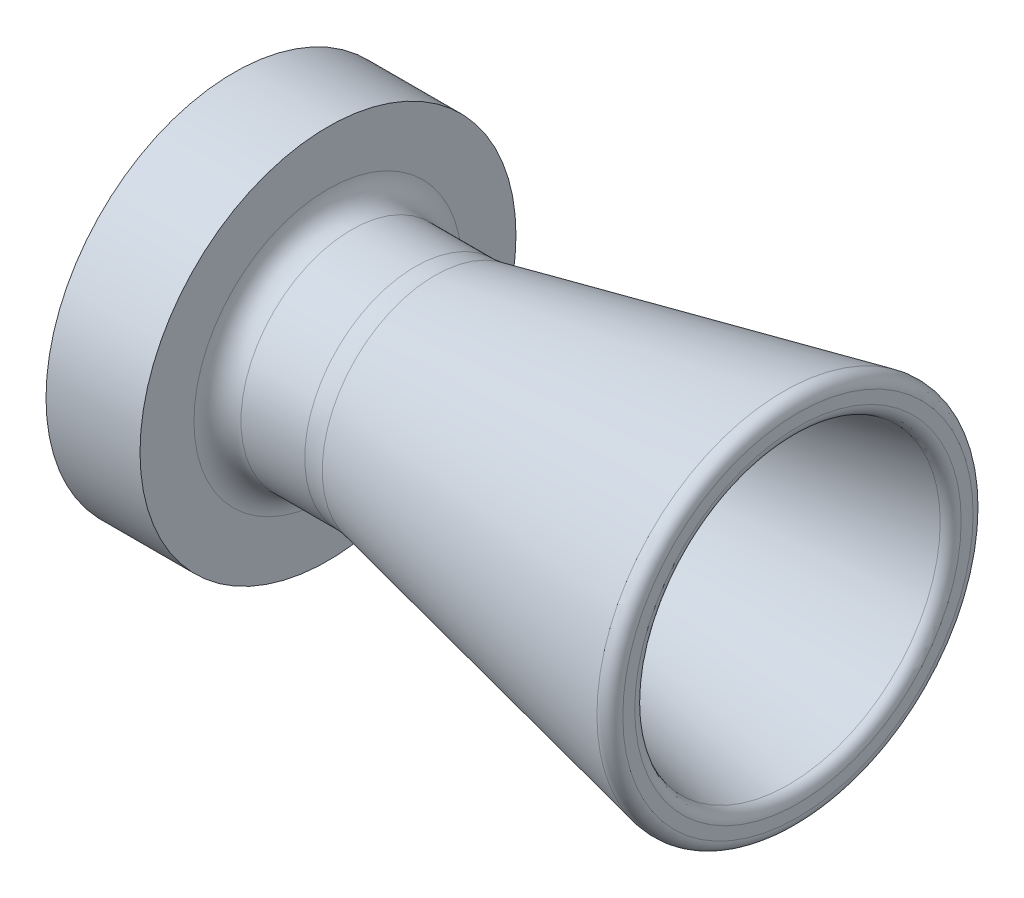
ISO-10303-21;
HEADER;
FILE_DESCRIPTION(('STEP AP214'),'2;1');
FILE_NAME('part.step','',(''),(''),'','','');
FILE_SCHEMA(('AUTOMOTIVE_DESIGN { 1 0 10303 214 1 1 1 1 }'));
ENDSEC;
DATA;
#1=APPLICATION_CONTEXT('core data for automotive mechanical design processes');
#2=APPLICATION_PROTOCOL_DEFINITION('international standard','automotive_design',2000,#1);
#3=PRODUCT_CONTEXT('',#1,'mechanical');
#4=PRODUCT('Part','Part','',(#3));
#5=PRODUCT_RELATED_PRODUCT_CATEGORY('part','',(#4));
#6=PRODUCT_DEFINITION_FORMATION('','',#4);
#7=PRODUCT_DEFINITION_CONTEXT('part definition',#1,'design');
#8=PRODUCT_DEFINITION('design','',#6,#7);
#9=PRODUCT_DEFINITION_SHAPE('','',#8);
#10=(LENGTH_UNIT() NAMED_UNIT(*) SI_UNIT(.MILLI.,.METRE.));
#11=(NAMED_UNIT(*) PLANE_ANGLE_UNIT() SI_UNIT($,.RADIAN.));
#12=(NAMED_UNIT(*) SI_UNIT($,.STERADIAN.) SOLID_ANGLE_UNIT());
#13=UNCERTAINTY_MEASURE_WITH_UNIT(LENGTH_MEASURE(1.E-05),#10,'distance_accuracy_value','');
#14=(GEOMETRIC_REPRESENTATION_CONTEXT(3) GLOBAL_UNCERTAINTY_ASSIGNED_CONTEXT((#13)) GLOBAL_UNIT_ASSIGNED_CONTEXT((#10,
#11,#12)) REPRESENTATION_CONTEXT('',''));
#15=CARTESIAN_POINT('',(0.,0.,0.));
#16=DIRECTION('',(0.,0.,1.));
#17=DIRECTION('',(1.,0.,0.));
#18=AXIS2_PLACEMENT_3D('',#15,#16,#17);
#19=CARTESIAN_POINT('',(-76.2,0.,9.525));
#20=DIRECTION('',(1.,0.,0.));
#21=DIRECTION('',(0.,0.,-1.));
#22=AXIS2_PLACEMENT_3D('',#19,#20,#21);
#23=PLANE('',#22);
#24=CARTESIAN_POINT('',(-76.2,0.,0.));
#25=DIRECTION('',(1.,0.,0.));
#26=DIRECTION('',(0.,0.,-1.));
#27=AXIS2_PLACEMENT_3D('',#24,#25,#26);
#28=CIRCLE('',#27,25.4);
#29=CARTESIAN_POINT('',(-76.2,0.,-25.4));
#30=VERTEX_POINT('',#29);
#31=EDGE_CURVE('E80',#30,#30,#28,.T.);
#32=ORIENTED_EDGE('',*,*,#31,.F.);
#33=EDGE_LOOP('',(#32));
#34=FACE_BOUND('',#33,.T.);
#35=CARTESIAN_POINT('',(-76.2,0.,0.));
#36=DIRECTION('',(1.,0.,0.));
#37=DIRECTION('',(0.,0.,-1.));
#38=AXIS2_PLACEMENT_3D('',#35,#36,#37);
#39=CIRCLE('',#38,9.525);
#40=CARTESIAN_POINT('',(-76.2,0.,-9.525));
#41=VERTEX_POINT('',#40);
#42=EDGE_CURVE('E10',#41,#41,#39,.T.);
#43=ORIENTED_EDGE('',*,*,#42,.T.);
#44=EDGE_LOOP('',(#43));
#45=FACE_BOUND('',#44,.T.);
#46=ADVANCED_FACE('F31',(#34,#45),#23,.F.);
#47=CARTESIAN_POINT('',(88.99,0.,0.));
#48=DIRECTION('',(1.,0.,0.));
#49=DIRECTION('',(0.,0.,-1.));
#50=AXIS2_PLACEMENT_3D('',#47,#48,#49);
#51=CYLINDRICAL_SURFACE('',#50,9.525);
#52=CARTESIAN_POINT('',(-63.5,0.,0.));
#53=DIRECTION('',(1.,0.,0.));
#54=DIRECTION('',(0.,0.,-1.));
#55=AXIS2_PLACEMENT_3D('',#52,#53,#54);
#56=CIRCLE('',#55,9.525);
#57=CARTESIAN_POINT('',(-63.5,0.,-9.525));
#58=VERTEX_POINT('',#57);
#59=EDGE_CURVE('E37',#58,#58,#56,.T.);
#60=ORIENTED_EDGE('',*,*,#59,.T.);
#61=EDGE_LOOP('',(#60));
#62=FACE_BOUND('',#61,.T.);
#63=ORIENTED_EDGE('',*,*,#42,.F.);
#64=EDGE_LOOP('',(#63));
#65=FACE_BOUND('',#64,.T.);
#66=ADVANCED_FACE('F87',(#62,#65),#51,.F.);
#67=CARTESIAN_POINT('',(-63.5,0.,9.525));
#68=DIRECTION('',(1.,0.,0.));
#69=DIRECTION('',(0.,0.,-1.));
#70=AXIS2_PLACEMENT_3D('',#67,#68,#69);
#71=PLANE('',#70);
#72=CARTESIAN_POINT('',(-63.5,0.,0.));
#73=DIRECTION('',(1.,0.,0.));
#74=DIRECTION('',(0.,0.,-1.));
#75=AXIS2_PLACEMENT_3D('',#72,#73,#74);
#76=CIRCLE('',#75,10.16);
#77=CARTESIAN_POINT('',(-63.5,0.,-10.16));
#78=VERTEX_POINT('',#77);
#79=EDGE_CURVE('E41',#78,#78,#76,.T.);
#80=ORIENTED_EDGE('',*,*,#79,.T.);
#81=EDGE_LOOP('',(#80));
#82=FACE_BOUND('',#81,.T.);
#83=ORIENTED_EDGE('',*,*,#59,.F.);
#84=EDGE_LOOP('',(#83));
#85=FACE_BOUND('',#84,.T.);
#86=ADVANCED_FACE('F91',(#82,#85),#71,.T.);
#87=CARTESIAN_POINT('',(88.99,0.,0.));
#88=DIRECTION('',(1.,0.,0.));
#89=DIRECTION('',(0.,0.,-1.));
#90=AXIS2_PLACEMENT_3D('',#87,#88,#89);
#91=CYLINDRICAL_SURFACE('',#90,10.16);
#92=CARTESIAN_POINT('',(-51.2011300436334,0.,0.));
#93=DIRECTION('',(1.,0.,0.));
#94=DIRECTION('',(0.,0.,-1.));
#95=AXIS2_PLACEMENT_3D('',#92,#93,#94);
#96=CIRCLE('',#95,10.16);
#97=CARTESIAN_POINT('',(-51.2011300436334,0.,-10.16));
#98=VERTEX_POINT('',#97);
#99=EDGE_CURVE('E45',#98,#98,#96,.T.);
#100=ORIENTED_EDGE('',*,*,#99,.T.);
#101=EDGE_LOOP('',(#100));
#102=FACE_BOUND('',#101,.T.);
#103=ORIENTED_EDGE('',*,*,#79,.F.);
#104=EDGE_LOOP('',(#103));
#105=FACE_BOUND('',#104,.T.);
#106=ADVANCED_FACE('F95',(#102,#105),#91,.F.);
#107=CARTESIAN_POINT('',(-51.2011300436334,0.,0.));
#108=DIRECTION('',(1.,0.,0.));
#109=DIRECTION('',(0.,0.,-1.));
#110=AXIS2_PLACEMENT_3D('',#107,#108,#109);
#111=TOROIDAL_SURFACE('',#110,22.86,12.7);
#112=CARTESIAN_POINT('',(-48.560651570248,0.,0.));
#113=DIRECTION('',(1.,0.,0.));
#114=DIRECTION('',(0.,0.,-1.));
#115=AXIS2_PLACEMENT_3D('',#112,#113,#114);
#116=CIRCLE('',#115,10.4375254706807);
#117=CARTESIAN_POINT('',(-48.560651570248,0.,-10.4375254706807));
#118=VERTEX_POINT('',#117);
#119=EDGE_CURVE('E50',#118,#118,#116,.T.);
#120=ORIENTED_EDGE('',*,*,#119,.T.);
#121=EDGE_LOOP('',(#120));
#122=FACE_BOUND('',#121,.T.);
#123=ORIENTED_EDGE('',*,*,#99,.F.);
#124=EDGE_LOOP('',(#123));
#125=FACE_BOUND('',#124,.T.);
#126=ADVANCED_FACE('F102',(#122,#125),#111,.T.);
#127=CARTESIAN_POINT('',(-1.26749971235345,0.,0.));
#128=DIRECTION('',(1.,0.,0.));
#129=DIRECTION('',(0.,0.,-1.));
#130=AXIS2_PLACEMENT_3D('',#127,#128,#129);
#131=CONICAL_SURFACE('',#130,20.4899952201326,0.209439510239313);
#132=ORIENTED_EDGE('',*,*,#119,.F.);
#133=EDGE_LOOP('',(#132));
#134=FACE_BOUND('',#133,.T.);
#135=CARTESIAN_POINT('',(-1.26749971235345,0.,0.));
#136=DIRECTION('',(1.,0.,0.));
#137=DIRECTION('',(0.,0.,-1.));
#138=AXIS2_PLACEMENT_3D('',#135,#136,#137);
#139=CIRCLE('',#138,20.4899952201326);
#140=CARTESIAN_POINT('',(-1.26749971235345,0.,-20.4899952201326));
#141=VERTEX_POINT('',#140);
#142=EDGE_CURVE('E53',#141,#141,#139,.T.);
#143=ORIENTED_EDGE('',*,*,#142,.T.);
#144=EDGE_LOOP('',(#143));
#145=FACE_BOUND('',#144,.T.);
#146=ADVANCED_FACE('F106',(#134,#145),#131,.F.);
#147=CARTESIAN_POINT('',(-1.60020000000001,0.,0.));
#148=DIRECTION('',(1.,0.,0.));
#149=DIRECTION('',(0.,0.,-1.));
#150=AXIS2_PLACEMENT_3D('',#147,#148,#149);
#151=TOROIDAL_SURFACE('',#150,22.0552270108268,1.6002);
#152=ORIENTED_EDGE('',*,*,#142,.F.);
#153=EDGE_LOOP('',(#152));
#154=FACE_BOUND('',#153,.T.);
#155=CARTESIAN_POINT('',(0.,0.,0.));
#156=DIRECTION('',(1.,0.,0.));
#157=DIRECTION('',(0.,0.,-1.));
#158=AXIS2_PLACEMENT_3D('',#155,#156,#157);
#159=CIRCLE('',#158,22.0552270108268);
#160=CARTESIAN_POINT('',(0.,0.,-22.0552270108268));
#161=VERTEX_POINT('',#160);
#162=EDGE_CURVE('E56',#161,#161,#159,.T.);
#163=ORIENTED_EDGE('',*,*,#162,.T.);
#164=EDGE_LOOP('',(#163));
#165=FACE_BOUND('',#164,.T.);
#166=ADVANCED_FACE('F110',(#154,#165),#151,.T.);
#167=CARTESIAN_POINT('',(0.,0.,22.0552270108268));
#168=DIRECTION('',(1.,0.,0.));
#169=DIRECTION('',(0.,0.,-1.));
#170=AXIS2_PLACEMENT_3D('',#167,#168,#169);
#171=PLANE('',#170);
#172=CARTESIAN_POINT('',(0.,0.,0.));
#173=DIRECTION('',(1.,0.,0.));
#174=DIRECTION('',(0.,0.,-1.));
#175=AXIS2_PLACEMENT_3D('',#172,#173,#174);
#176=CIRCLE('',#175,23.6652089796203);
#177=CARTESIAN_POINT('',(0.,0.,-23.6652089796203));
#178=VERTEX_POINT('',#177);
#179=EDGE_CURVE('E59',#178,#178,#176,.T.);
#180=ORIENTED_EDGE('',*,*,#179,.T.);
#181=EDGE_LOOP('',(#180));
#182=FACE_BOUND('',#181,.T.);
#183=ORIENTED_EDGE('',*,*,#162,.F.);
#184=EDGE_LOOP('',(#183));
#185=FACE_BOUND('',#184,.T.);
#186=ADVANCED_FACE('F114',(#182,#185),#171,.T.);
#187=CARTESIAN_POINT('',(-1.60020000000001,0.,0.));
#188=DIRECTION('',(1.,0.,0.));
#189=DIRECTION('',(0.,0.,-1.));
#190=AXIS2_PLACEMENT_3D('',#187,#188,#189);
#191=TOROIDAL_SURFACE('',#190,23.6652089796203,1.6002);
#192=ORIENTED_EDGE('',*,*,#179,.F.);
#193=EDGE_LOOP('',(#192));
#194=FACE_BOUND('',#193,.T.);
#195=CARTESIAN_POINT('',(-1.93290028764657,0.,0.));
#196=DIRECTION('',(1.,0.,0.));
#197=DIRECTION('',(0.,0.,-1.));
#198=AXIS2_PLACEMENT_3D('',#195,#196,#197);
#199=CIRCLE('',#198,25.2304407703145);
#200=CARTESIAN_POINT('',(-1.93290028764657,0.,-25.2304407703145));
#201=VERTEX_POINT('',#200);
#202=EDGE_CURVE('E62',#201,#201,#199,.T.);
#203=ORIENTED_EDGE('',*,*,#202,.T.);
#204=EDGE_LOOP('',(#203));
#205=FACE_BOUND('',#204,.T.);
#206=ADVANCED_FACE('F118',(#194,#205),#191,.T.);
#207=CARTESIAN_POINT('',(-1.93290028764657,0.,0.));
#208=DIRECTION('',(1.,0.,0.));
#209=DIRECTION('',(0.,0.,-1.));
#210=AXIS2_PLACEMENT_3D('',#207,#208,#209);
#211=CONICAL_SURFACE('',#210,25.2304407703145,0.209439510239313);
#212=CARTESIAN_POINT('',(-49.0625453144886,0.,0.));
#213=DIRECTION('',(1.,0.,0.));
#214=DIRECTION('',(0.,0.,-1.));
#215=AXIS2_PLACEMENT_3D('',#212,#213,#214);
#216=CIRCLE('',#215,15.2127254706806);
#217=CARTESIAN_POINT('',(-49.0625453144886,0.,-15.2127254706806));
#218=VERTEX_POINT('',#217);
#219=EDGE_CURVE('E65',#218,#218,#216,.T.);
#220=ORIENTED_EDGE('',*,*,#219,.T.);
#221=EDGE_LOOP('',(#220));
#222=FACE_BOUND('',#221,.T.);
#223=ORIENTED_EDGE('',*,*,#202,.F.);
#224=EDGE_LOOP('',(#223));
#225=FACE_BOUND('',#224,.T.);
#226=ADVANCED_FACE('F122',(#222,#225),#211,.T.);
#227=CARTESIAN_POINT('',(-51.7030237878741,0.,0.));
#228=DIRECTION('',(1.,0.,0.));
#229=DIRECTION('',(0.,0.,-1.));
#230=AXIS2_PLACEMENT_3D('',#227,#228,#229);
#231=TOROIDAL_SURFACE('',#230,27.6352,12.7);
#232=ORIENTED_EDGE('',*,*,#219,.F.);
#233=EDGE_LOOP('',(#232));
#234=FACE_BOUND('',#233,.T.);
#235=CARTESIAN_POINT('',(-51.703023787874,0.,0.));
#236=DIRECTION('',(1.,0.,0.));
#237=DIRECTION('',(0.,0.,-1.));
#238=AXIS2_PLACEMENT_3D('',#235,#236,#237);
#239=CIRCLE('',#238,14.9352);
#240=CARTESIAN_POINT('',(-51.703023787874,0.,-14.9352));
#241=VERTEX_POINT('',#240);
#242=EDGE_CURVE('E68',#241,#241,#239,.T.);
#243=ORIENTED_EDGE('',*,*,#242,.T.);
#244=EDGE_LOOP('',(#243));
#245=FACE_BOUND('',#244,.T.);
#246=ADVANCED_FACE('F126',(#234,#245),#231,.F.);
#247=CARTESIAN_POINT('',(88.99,0.,0.));
#248=DIRECTION('',(1.,0.,0.));
#249=DIRECTION('',(0.,0.,-1.));
#250=AXIS2_PLACEMENT_3D('',#247,#248,#249);
#251=CYLINDRICAL_SURFACE('',#250,14.9352);
#252=CARTESIAN_POINT('',(-60.325,0.,0.));
#253=DIRECTION('',(1.,0.,0.));
#254=DIRECTION('',(0.,0.,-1.));
#255=AXIS2_PLACEMENT_3D('',#252,#253,#254);
#256=CIRCLE('',#255,14.9352);
#257=CARTESIAN_POINT('',(-60.325,0.,-14.9352));
#258=VERTEX_POINT('',#257);
#259=EDGE_CURVE('E71',#258,#258,#256,.T.);
#260=ORIENTED_EDGE('',*,*,#259,.T.);
#261=EDGE_LOOP('',(#260));
#262=FACE_BOUND('',#261,.T.);
#263=ORIENTED_EDGE('',*,*,#242,.F.);
#264=EDGE_LOOP('',(#263));
#265=FACE_BOUND('',#264,.T.);
#266=ADVANCED_FACE('F130',(#262,#265),#251,.T.);
#267=CARTESIAN_POINT('',(-60.325,0.,0.));
#268=DIRECTION('',(1.,0.,0.));
#269=DIRECTION('',(0.,0.,-1.));
#270=AXIS2_PLACEMENT_3D('',#267,#268,#269);
#271=TOROIDAL_SURFACE('',#270,18.1102,3.175);
#272=ORIENTED_EDGE('',*,*,#259,.F.);
#273=EDGE_LOOP('',(#272));
#274=FACE_BOUND('',#273,.T.);
#275=CARTESIAN_POINT('',(-63.5,0.,0.));
#276=DIRECTION('',(1.,0.,0.));
#277=DIRECTION('',(0.,0.,-1.));
#278=AXIS2_PLACEMENT_3D('',#275,#276,#277);
#279=CIRCLE('',#278,18.1102);
#280=CARTESIAN_POINT('',(-63.5,0.,-18.1102));
#281=VERTEX_POINT('',#280);
#282=EDGE_CURVE('E74',#281,#281,#279,.T.);
#283=ORIENTED_EDGE('',*,*,#282,.T.);
#284=EDGE_LOOP('',(#283));
#285=FACE_BOUND('',#284,.T.);
#286=ADVANCED_FACE('F134',(#274,#285),#271,.F.);
#287=CARTESIAN_POINT('',(-63.5,0.,18.1102));
#288=DIRECTION('',(1.,0.,0.));
#289=DIRECTION('',(0.,0.,-1.));
#290=AXIS2_PLACEMENT_3D('',#287,#288,#289);
#291=PLANE('',#290);
#292=CARTESIAN_POINT('',(-63.5,0.,0.));
#293=DIRECTION('',(1.,0.,0.));
#294=DIRECTION('',(0.,0.,-1.));
#295=AXIS2_PLACEMENT_3D('',#292,#293,#294);
#296=CIRCLE('',#295,25.4);
#297=CARTESIAN_POINT('',(-63.5,0.,-25.4));
#298=VERTEX_POINT('',#297);
#299=EDGE_CURVE('E77',#298,#298,#296,.T.);
#300=ORIENTED_EDGE('',*,*,#299,.T.);
#301=EDGE_LOOP('',(#300));
#302=FACE_BOUND('',#301,.T.);
#303=ORIENTED_EDGE('',*,*,#282,.F.);
#304=EDGE_LOOP('',(#303));
#305=FACE_BOUND('',#304,.T.);
#306=ADVANCED_FACE('F138',(#302,#305),#291,.T.);
#307=CARTESIAN_POINT('',(88.99,0.,0.));
#308=DIRECTION('',(1.,0.,0.));
#309=DIRECTION('',(0.,0.,-1.));
#310=AXIS2_PLACEMENT_3D('',#307,#308,#309);
#311=CYLINDRICAL_SURFACE('',#310,25.4);
#312=ORIENTED_EDGE('',*,*,#299,.F.);
#313=EDGE_LOOP('',(#312));
#314=FACE_BOUND('',#313,.T.);
#315=ORIENTED_EDGE('',*,*,#31,.T.);
#316=EDGE_LOOP('',(#315));
#317=FACE_BOUND('',#316,.T.);
#318=ADVANCED_FACE('F84',(#314,#317),#311,.T.);
#319=CLOSED_SHELL('',(#46,#66,#86,#106,#126,#146,#166,#186,#206,#226,#246,#266,#286,#306,#318));
#320=MANIFOLD_SOLID_BREP('B2',#319);
#321=ADVANCED_BREP_SHAPE_REPRESENTATION('',(#18,#320),#14);
#322=SHAPE_DEFINITION_REPRESENTATION(#9,#321);
ENDSEC;
END-ISO-10303-21;
